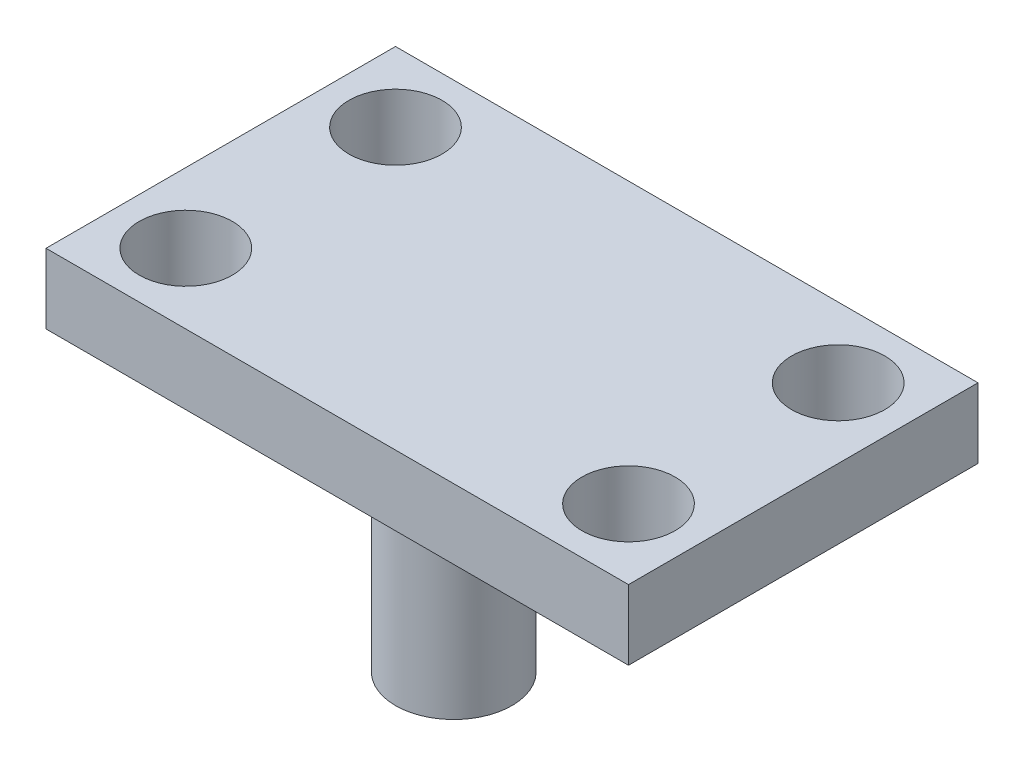
ISO-10303-21;
HEADER;
FILE_DESCRIPTION(('STEP AP214'),'2;1');
FILE_NAME('part.step','',(''),(''),'','','');
FILE_SCHEMA(('AUTOMOTIVE_DESIGN { 1 0 10303 214 1 1 1 1 }'));
ENDSEC;
DATA;
#1=APPLICATION_CONTEXT('core data for automotive mechanical design processes');
#2=APPLICATION_PROTOCOL_DEFINITION('international standard','automotive_design',2000,#1);
#3=PRODUCT_CONTEXT('',#1,'mechanical');
#4=PRODUCT('Part','Part','',(#3));
#5=PRODUCT_RELATED_PRODUCT_CATEGORY('part','',(#4));
#6=PRODUCT_DEFINITION_FORMATION('','',#4);
#7=PRODUCT_DEFINITION_CONTEXT('part definition',#1,'design');
#8=PRODUCT_DEFINITION('design','',#6,#7);
#9=PRODUCT_DEFINITION_SHAPE('','',#8);
#10=(LENGTH_UNIT() NAMED_UNIT(*) SI_UNIT(.MILLI.,.METRE.));
#11=(NAMED_UNIT(*) PLANE_ANGLE_UNIT() SI_UNIT($,.RADIAN.));
#12=(NAMED_UNIT(*) SI_UNIT($,.STERADIAN.) SOLID_ANGLE_UNIT());
#13=UNCERTAINTY_MEASURE_WITH_UNIT(LENGTH_MEASURE(1.E-05),#10,'distance_accuracy_value','');
#14=(GEOMETRIC_REPRESENTATION_CONTEXT(3) GLOBAL_UNCERTAINTY_ASSIGNED_CONTEXT((#13)) GLOBAL_UNIT_ASSIGNED_CONTEXT((#10,
#11,#12)) REPRESENTATION_CONTEXT('',''));
#15=CARTESIAN_POINT('',(0.,0.,0.));
#16=DIRECTION('',(0.,0.,1.));
#17=DIRECTION('',(1.,0.,0.));
#18=AXIS2_PLACEMENT_3D('',#15,#16,#17);
#19=CARTESIAN_POINT('',(0.,30.,0.));
#20=DIRECTION('',(0.,-1.,0.));
#21=DIRECTION('',(0.,0.,-1.));
#22=AXIS2_PLACEMENT_3D('',#19,#20,#21);
#23=PLANE('',#22);
#24=DIRECTION('',(0.,0.,1.));
#25=VECTOR('',#24,1.);
#26=CARTESIAN_POINT('',(0.,30.,0.));
#27=LINE('',#26,#25);
#28=CARTESIAN_POINT('',(0.,30.,-150.));
#29=VERTEX_POINT('',#28);
#30=CARTESIAN_POINT('',(0.,30.,0.));
#31=VERTEX_POINT('',#30);
#32=EDGE_CURVE('E90',#29,#31,#27,.T.);
#33=ORIENTED_EDGE('',*,*,#32,.T.);
#34=DIRECTION('',(1.,0.,0.));
#35=VECTOR('',#34,1.);
#36=CARTESIAN_POINT('',(0.,30.,0.));
#37=LINE('',#36,#35);
#38=CARTESIAN_POINT('',(250.,30.,0.));
#39=VERTEX_POINT('',#38);
#40=EDGE_CURVE('E85',#31,#39,#37,.T.);
#41=ORIENTED_EDGE('',*,*,#40,.T.);
#42=DIRECTION('',(0.,0.,-1.));
#43=VECTOR('',#42,1.);
#44=CARTESIAN_POINT('',(250.,30.,0.));
#45=LINE('',#44,#43);
#46=CARTESIAN_POINT('',(250.,30.,-150.));
#47=VERTEX_POINT('',#46);
#48=EDGE_CURVE('E88',#39,#47,#45,.T.);
#49=ORIENTED_EDGE('',*,*,#48,.T.);
#50=DIRECTION('',(-1.,0.,0.));
#51=VECTOR('',#50,1.);
#52=CARTESIAN_POINT('',(0.,30.,-150.));
#53=LINE('',#52,#51);
#54=EDGE_CURVE('E54',#47,#29,#53,.T.);
#55=ORIENTED_EDGE('',*,*,#54,.T.);
#56=EDGE_LOOP('',(#33,#41,#49,#55));
#57=FACE_BOUND('',#56,.T.);
#58=CARTESIAN_POINT('',(30.,30.,-120.));
#59=DIRECTION('',(0.,1.,0.));
#60=DIRECTION('',(0.,0.,1.));
#61=AXIS2_PLACEMENT_3D('',#58,#59,#60);
#62=CIRCLE('',#61,20.);
#63=CARTESIAN_POINT('',(30.,30.,-100.));
#64=VERTEX_POINT('',#63);
#65=EDGE_CURVE('E107',#64,#64,#62,.T.);
#66=ORIENTED_EDGE('',*,*,#65,.F.);
#67=EDGE_LOOP('',(#66));
#68=FACE_BOUND('',#67,.T.);
#69=CARTESIAN_POINT('',(30.,30.,-30.));
#70=DIRECTION('',(0.,1.,0.));
#71=DIRECTION('',(0.,0.,1.));
#72=AXIS2_PLACEMENT_3D('',#69,#70,#71);
#73=CIRCLE('',#72,20.);
#74=CARTESIAN_POINT('',(30.,30.,-9.99999999999999));
#75=VERTEX_POINT('',#74);
#76=EDGE_CURVE('E142',#75,#75,#73,.T.);
#77=ORIENTED_EDGE('',*,*,#76,.F.);
#78=EDGE_LOOP('',(#77));
#79=FACE_BOUND('',#78,.T.);
#80=CARTESIAN_POINT('',(220.,30.,-120.));
#81=DIRECTION('',(0.,1.,0.));
#82=DIRECTION('',(0.,0.,-1.));
#83=AXIS2_PLACEMENT_3D('',#80,#81,#82);
#84=CIRCLE('',#83,20.);
#85=CARTESIAN_POINT('',(220.,30.,-140.));
#86=VERTEX_POINT('',#85);
#87=EDGE_CURVE('E137',#86,#86,#84,.T.);
#88=ORIENTED_EDGE('',*,*,#87,.F.);
#89=EDGE_LOOP('',(#88));
#90=FACE_BOUND('',#89,.T.);
#91=CARTESIAN_POINT('',(220.,30.,-30.));
#92=DIRECTION('',(0.,1.,0.));
#93=DIRECTION('',(0.,0.,-1.));
#94=AXIS2_PLACEMENT_3D('',#91,#92,#93);
#95=CIRCLE('',#94,20.);
#96=CARTESIAN_POINT('',(220.,30.,-50.));
#97=VERTEX_POINT('',#96);
#98=EDGE_CURVE('E128',#97,#97,#95,.T.);
#99=ORIENTED_EDGE('',*,*,#98,.F.);
#100=EDGE_LOOP('',(#99));
#101=FACE_BOUND('',#100,.T.);
#102=ADVANCED_FACE('F37',(#57,#68,#79,#90,#101),#23,.F.);
#103=CARTESIAN_POINT('',(0.,0.,0.));
#104=DIRECTION('',(0.,-1.,0.));
#105=DIRECTION('',(0.,0.,-1.));
#106=AXIS2_PLACEMENT_3D('',#103,#104,#105);
#107=PLANE('',#106);
#108=CARTESIAN_POINT('',(125.,0.,-50.));
#109=DIRECTION('',(0.,-1.,0.));
#110=DIRECTION('',(0.,0.,-1.));
#111=AXIS2_PLACEMENT_3D('',#108,#109,#110);
#112=CIRCLE('',#111,25.);
#113=CARTESIAN_POINT('',(125.,0.,-75.));
#114=VERTEX_POINT('',#113);
#115=EDGE_CURVE('E11',#114,#114,#112,.T.);
#116=ORIENTED_EDGE('',*,*,#115,.F.);
#117=EDGE_LOOP('',(#116));
#118=FACE_BOUND('',#117,.T.);
#119=CARTESIAN_POINT('',(220.,0.,-120.));
#120=DIRECTION('',(0.,1.,0.));
#121=DIRECTION('',(0.,0.,-1.));
#122=AXIS2_PLACEMENT_3D('',#119,#120,#121);
#123=CIRCLE('',#122,20.);
#124=CARTESIAN_POINT('',(220.,0.,-140.));
#125=VERTEX_POINT('',#124);
#126=EDGE_CURVE('E132',#125,#125,#123,.T.);
#127=ORIENTED_EDGE('',*,*,#126,.T.);
#128=EDGE_LOOP('',(#127));
#129=FACE_BOUND('',#128,.T.);
#130=CARTESIAN_POINT('',(30.,0.,-120.));
#131=DIRECTION('',(0.,1.,0.));
#132=DIRECTION('',(0.,0.,1.));
#133=AXIS2_PLACEMENT_3D('',#130,#131,#132);
#134=CIRCLE('',#133,20.);
#135=CARTESIAN_POINT('',(30.,0.,-100.));
#136=VERTEX_POINT('',#135);
#137=EDGE_CURVE('E145',#136,#136,#134,.T.);
#138=ORIENTED_EDGE('',*,*,#137,.T.);
#139=EDGE_LOOP('',(#138));
#140=FACE_BOUND('',#139,.T.);
#141=DIRECTION('',(0.,0.,1.));
#142=VECTOR('',#141,1.);
#143=CARTESIAN_POINT('',(0.,0.,0.));
#144=LINE('',#143,#142);
#145=CARTESIAN_POINT('',(0.,0.,-150.));
#146=VERTEX_POINT('',#145);
#147=CARTESIAN_POINT('',(0.,0.,0.));
#148=VERTEX_POINT('',#147);
#149=EDGE_CURVE('E104',#146,#148,#144,.T.);
#150=ORIENTED_EDGE('',*,*,#149,.F.);
#151=DIRECTION('',(-1.,0.,0.));
#152=VECTOR('',#151,1.);
#153=CARTESIAN_POINT('',(0.,0.,-150.));
#154=LINE('',#153,#152);
#155=CARTESIAN_POINT('',(250.,0.,-150.));
#156=VERTEX_POINT('',#155);
#157=EDGE_CURVE('E77',#156,#146,#154,.T.);
#158=ORIENTED_EDGE('',*,*,#157,.F.);
#159=DIRECTION('',(0.,0.,-1.));
#160=VECTOR('',#159,1.);
#161=CARTESIAN_POINT('',(250.,0.,0.));
#162=LINE('',#161,#160);
#163=CARTESIAN_POINT('',(250.,0.,0.));
#164=VERTEX_POINT('',#163);
#165=EDGE_CURVE('E71',#164,#156,#162,.T.);
#166=ORIENTED_EDGE('',*,*,#165,.F.);
#167=DIRECTION('',(1.,0.,0.));
#168=VECTOR('',#167,1.);
#169=CARTESIAN_POINT('',(0.,0.,0.));
#170=LINE('',#169,#168);
#171=EDGE_CURVE('E95',#148,#164,#170,.T.);
#172=ORIENTED_EDGE('',*,*,#171,.F.);
#173=EDGE_LOOP('',(#150,#158,#166,#172));
#174=FACE_BOUND('',#173,.T.);
#175=CARTESIAN_POINT('',(30.,0.,-30.));
#176=DIRECTION('',(0.,1.,0.));
#177=DIRECTION('',(0.,0.,1.));
#178=AXIS2_PLACEMENT_3D('',#175,#176,#177);
#179=CIRCLE('',#178,20.);
#180=CARTESIAN_POINT('',(30.,0.,-9.99999999999999));
#181=VERTEX_POINT('',#180);
#182=EDGE_CURVE('E123',#181,#181,#179,.T.);
#183=ORIENTED_EDGE('',*,*,#182,.T.);
#184=EDGE_LOOP('',(#183));
#185=FACE_BOUND('',#184,.T.);
#186=CARTESIAN_POINT('',(220.,0.,-30.));
#187=DIRECTION('',(0.,1.,0.));
#188=DIRECTION('',(0.,0.,-1.));
#189=AXIS2_PLACEMENT_3D('',#186,#187,#188);
#190=CIRCLE('',#189,20.);
#191=CARTESIAN_POINT('',(220.,0.,-50.));
#192=VERTEX_POINT('',#191);
#193=EDGE_CURVE('E126',#192,#192,#190,.T.);
#194=ORIENTED_EDGE('',*,*,#193,.T.);
#195=EDGE_LOOP('',(#194));
#196=FACE_BOUND('',#195,.T.);
#197=ADVANCED_FACE('F115',(#118,#129,#140,#174,#185,#196),#107,.T.);
#198=CARTESIAN_POINT('',(0.,30.,0.));
#199=DIRECTION('',(1.,0.,0.));
#200=DIRECTION('',(0.,0.,-1.));
#201=AXIS2_PLACEMENT_3D('',#198,#199,#200);
#202=PLANE('',#201);
#203=ORIENTED_EDGE('',*,*,#149,.T.);
#204=DIRECTION('',(0.,-1.,0.));
#205=VECTOR('',#204,1.);
#206=CARTESIAN_POINT('',(0.,30.,0.));
#207=LINE('',#206,#205);
#208=EDGE_CURVE('E46',#31,#148,#207,.T.);
#209=ORIENTED_EDGE('',*,*,#208,.F.);
#210=ORIENTED_EDGE('',*,*,#32,.F.);
#211=DIRECTION('',(0.,-1.,0.));
#212=VECTOR('',#211,1.);
#213=CARTESIAN_POINT('',(0.,30.,-150.));
#214=LINE('',#213,#212);
#215=EDGE_CURVE('E100',#29,#146,#214,.T.);
#216=ORIENTED_EDGE('',*,*,#215,.T.);
#217=EDGE_LOOP('',(#203,#209,#210,#216));
#218=FACE_BOUND('',#217,.T.);
#219=ADVANCED_FACE('F39',(#218),#202,.F.);
#220=CARTESIAN_POINT('',(0.,30.,0.));
#221=DIRECTION('',(0.,0.,-1.));
#222=DIRECTION('',(-1.,0.,0.));
#223=AXIS2_PLACEMENT_3D('',#220,#221,#222);
#224=PLANE('',#223);
#225=ORIENTED_EDGE('',*,*,#171,.T.);
#226=DIRECTION('',(0.,-1.,0.));
#227=VECTOR('',#226,1.);
#228=CARTESIAN_POINT('',(250.,30.,0.));
#229=LINE('',#228,#227);
#230=EDGE_CURVE('E93',#39,#164,#229,.T.);
#231=ORIENTED_EDGE('',*,*,#230,.F.);
#232=ORIENTED_EDGE('',*,*,#40,.F.);
#233=ORIENTED_EDGE('',*,*,#208,.T.);
#234=EDGE_LOOP('',(#225,#231,#232,#233));
#235=FACE_BOUND('',#234,.T.);
#236=ADVANCED_FACE('F94',(#235),#224,.F.);
#237=CARTESIAN_POINT('',(250.,30.,0.));
#238=DIRECTION('',(-1.,0.,0.));
#239=DIRECTION('',(0.,0.,1.));
#240=AXIS2_PLACEMENT_3D('',#237,#238,#239);
#241=PLANE('',#240);
#242=ORIENTED_EDGE('',*,*,#165,.T.);
#243=DIRECTION('',(0.,-1.,0.));
#244=VECTOR('',#243,1.);
#245=CARTESIAN_POINT('',(250.,30.,-150.));
#246=LINE('',#245,#244);
#247=EDGE_CURVE('E96',#47,#156,#246,.T.);
#248=ORIENTED_EDGE('',*,*,#247,.F.);
#249=ORIENTED_EDGE('',*,*,#48,.F.);
#250=ORIENTED_EDGE('',*,*,#230,.T.);
#251=EDGE_LOOP('',(#242,#248,#249,#250));
#252=FACE_BOUND('',#251,.T.);
#253=ADVANCED_FACE('F98',(#252),#241,.F.);
#254=CARTESIAN_POINT('',(0.,30.,-150.));
#255=DIRECTION('',(0.,0.,1.));
#256=DIRECTION('',(1.,0.,0.));
#257=AXIS2_PLACEMENT_3D('',#254,#255,#256);
#258=PLANE('',#257);
#259=ORIENTED_EDGE('',*,*,#157,.T.);
#260=ORIENTED_EDGE('',*,*,#215,.F.);
#261=ORIENTED_EDGE('',*,*,#54,.F.);
#262=ORIENTED_EDGE('',*,*,#247,.T.);
#263=EDGE_LOOP('',(#259,#260,#261,#262));
#264=FACE_BOUND('',#263,.T.);
#265=ADVANCED_FACE('F156',(#264),#258,.F.);
#266=CARTESIAN_POINT('',(30.,30.,-120.));
#267=DIRECTION('',(0.,-1.,0.));
#268=DIRECTION('',(0.,0.,-1.));
#269=AXIS2_PLACEMENT_3D('',#266,#267,#268);
#270=CYLINDRICAL_SURFACE('',#269,20.);
#271=ORIENTED_EDGE('',*,*,#65,.T.);
#272=EDGE_LOOP('',(#271));
#273=FACE_BOUND('',#272,.T.);
#274=ORIENTED_EDGE('',*,*,#137,.F.);
#275=EDGE_LOOP('',(#274));
#276=FACE_BOUND('',#275,.T.);
#277=ADVANCED_FACE('F153',(#273,#276),#270,.F.);
#278=CARTESIAN_POINT('',(30.,30.,-30.));
#279=DIRECTION('',(0.,-1.,0.));
#280=DIRECTION('',(0.,0.,-1.));
#281=AXIS2_PLACEMENT_3D('',#278,#279,#280);
#282=CYLINDRICAL_SURFACE('',#281,20.);
#283=ORIENTED_EDGE('',*,*,#76,.T.);
#284=EDGE_LOOP('',(#283));
#285=FACE_BOUND('',#284,.T.);
#286=ORIENTED_EDGE('',*,*,#182,.F.);
#287=EDGE_LOOP('',(#286));
#288=FACE_BOUND('',#287,.T.);
#289=ADVANCED_FACE('F155',(#285,#288),#282,.F.);
#290=CARTESIAN_POINT('',(220.,30.,-120.));
#291=DIRECTION('',(0.,-1.,0.));
#292=DIRECTION('',(0.,0.,-1.));
#293=AXIS2_PLACEMENT_3D('',#290,#291,#292);
#294=CYLINDRICAL_SURFACE('',#293,20.);
#295=ORIENTED_EDGE('',*,*,#87,.T.);
#296=EDGE_LOOP('',(#295));
#297=FACE_BOUND('',#296,.T.);
#298=ORIENTED_EDGE('',*,*,#126,.F.);
#299=EDGE_LOOP('',(#298));
#300=FACE_BOUND('',#299,.T.);
#301=ADVANCED_FACE('F163',(#297,#300),#294,.F.);
#302=CARTESIAN_POINT('',(220.,30.,-30.));
#303=DIRECTION('',(0.,-1.,0.));
#304=DIRECTION('',(0.,0.,-1.));
#305=AXIS2_PLACEMENT_3D('',#302,#303,#304);
#306=CYLINDRICAL_SURFACE('',#305,20.);
#307=ORIENTED_EDGE('',*,*,#98,.T.);
#308=EDGE_LOOP('',(#307));
#309=FACE_BOUND('',#308,.T.);
#310=ORIENTED_EDGE('',*,*,#193,.F.);
#311=EDGE_LOOP('',(#310));
#312=FACE_BOUND('',#311,.T.);
#313=ADVANCED_FACE('F198',(#309,#312),#306,.F.);
#314=CARTESIAN_POINT('',(125.,-90.,-50.));
#315=DIRECTION('',(0.,1.,0.));
#316=DIRECTION('',(0.,0.,1.));
#317=AXIS2_PLACEMENT_3D('',#314,#315,#316);
#318=CYLINDRICAL_SURFACE('',#317,25.);
#319=ORIENTED_EDGE('',*,*,#115,.T.);
#320=EDGE_LOOP('',(#319));
#321=FACE_BOUND('',#320,.T.);
#322=CARTESIAN_POINT('',(125.,-90.,-50.));
#323=DIRECTION('',(0.,1.,0.));
#324=DIRECTION('',(0.,0.,1.));
#325=AXIS2_PLACEMENT_3D('',#322,#323,#324);
#326=CIRCLE('',#325,25.);
#327=CARTESIAN_POINT('',(125.,-90.,-25.));
#328=VERTEX_POINT('',#327);
#329=EDGE_CURVE('E129',#328,#328,#326,.T.);
#330=ORIENTED_EDGE('',*,*,#329,.T.);
#331=EDGE_LOOP('',(#330));
#332=FACE_BOUND('',#331,.T.);
#333=ADVANCED_FACE('F192',(#321,#332),#318,.T.);
#334=CARTESIAN_POINT('',(125.,-90.,-50.));
#335=DIRECTION('',(0.,1.,0.));
#336=DIRECTION('',(0.,0.,1.));
#337=AXIS2_PLACEMENT_3D('',#334,#335,#336);
#338=PLANE('',#337);
#339=ORIENTED_EDGE('',*,*,#329,.F.);
#340=EDGE_LOOP('',(#339));
#341=FACE_BOUND('',#340,.T.);
#342=ADVANCED_FACE('F197',(#341),#338,.F.);
#343=CLOSED_SHELL('',(#102,#197,#219,#236,#253,#265,#277,#289,#301,#313,#333,#342));
#344=MANIFOLD_SOLID_BREP('B2',#343);
#345=ADVANCED_BREP_SHAPE_REPRESENTATION('',(#18,#344),#14);
#346=SHAPE_DEFINITION_REPRESENTATION(#9,#345);
ENDSEC;
END-ISO-10303-21;
